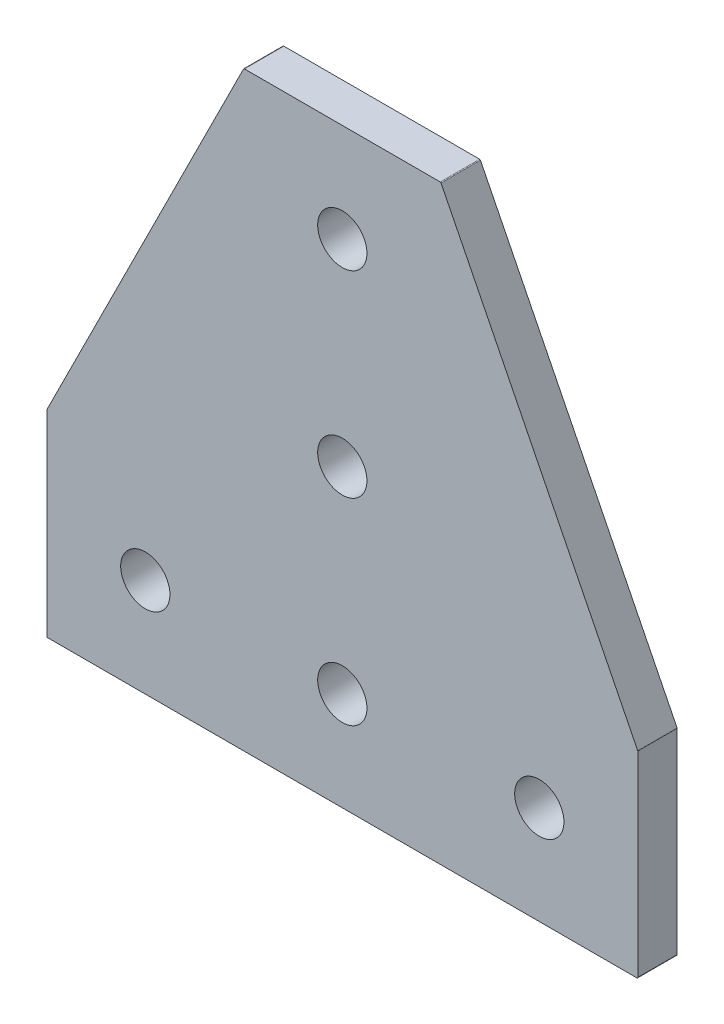
ISO-10303-21;
HEADER;
FILE_DESCRIPTION(('STEP AP214'),'2;1');
FILE_NAME('part.step','',(''),(''),'','','');
FILE_SCHEMA(('AUTOMOTIVE_DESIGN { 1 0 10303 214 1 1 1 1 }'));
ENDSEC;
DATA;
#1=APPLICATION_CONTEXT('core data for automotive mechanical design processes');
#2=APPLICATION_PROTOCOL_DEFINITION('international standard','automotive_design',2000,#1);
#3=PRODUCT_CONTEXT('',#1,'mechanical');
#4=PRODUCT('Part','Part','',(#3));
#5=PRODUCT_RELATED_PRODUCT_CATEGORY('part','',(#4));
#6=PRODUCT_DEFINITION_FORMATION('','',#4);
#7=PRODUCT_DEFINITION_CONTEXT('part definition',#1,'design');
#8=PRODUCT_DEFINITION('design','',#6,#7);
#9=PRODUCT_DEFINITION_SHAPE('','',#8);
#10=(LENGTH_UNIT() NAMED_UNIT(*) SI_UNIT(.MILLI.,.METRE.));
#11=(NAMED_UNIT(*) PLANE_ANGLE_UNIT() SI_UNIT($,.RADIAN.));
#12=(NAMED_UNIT(*) SI_UNIT($,.STERADIAN.) SOLID_ANGLE_UNIT());
#13=UNCERTAINTY_MEASURE_WITH_UNIT(LENGTH_MEASURE(1.E-05),#10,'distance_accuracy_value','');
#14=(GEOMETRIC_REPRESENTATION_CONTEXT(3) GLOBAL_UNCERTAINTY_ASSIGNED_CONTEXT((#13)) GLOBAL_UNIT_ASSIGNED_CONTEXT((#10,
#11,#12)) REPRESENTATION_CONTEXT('',''));
#15=CARTESIAN_POINT('',(0.,0.,0.));
#16=DIRECTION('',(0.,0.,1.));
#17=DIRECTION('',(1.,0.,0.));
#18=AXIS2_PLACEMENT_3D('',#15,#16,#17);
#19=CARTESIAN_POINT('',(0.,0.,-4.));
#20=DIRECTION('',(0.,-1.,0.));
#21=DIRECTION('',(0.,0.,-1.));
#22=AXIS2_PLACEMENT_3D('',#19,#20,#21);
#23=PLANE('',#22);
#24=DIRECTION('',(1.,0.,0.));
#25=VECTOR('',#24,1.);
#26=CARTESIAN_POINT('',(0.,0.,0.));
#27=LINE('',#26,#25);
#28=CARTESIAN_POINT('',(0.1,0.,0.));
#29=VERTEX_POINT('',#28);
#30=CARTESIAN_POINT('',(59.9,0.,0.));
#31=VERTEX_POINT('',#30);
#32=EDGE_CURVE('E214',#29,#31,#27,.T.);
#33=ORIENTED_EDGE('',*,*,#32,.F.);
#34=DIRECTION('',(0.,0.,1.));
#35=VECTOR('',#34,1.);
#36=CARTESIAN_POINT('',(0.1,0.,-4.));
#37=LINE('',#36,#35);
#38=CARTESIAN_POINT('',(0.1,0.,-4.));
#39=VERTEX_POINT('',#38);
#40=EDGE_CURVE('E171',#29,#39,#37,.F.);
#41=ORIENTED_EDGE('',*,*,#40,.T.);
#42=DIRECTION('',(1.,0.,0.));
#43=VECTOR('',#42,1.);
#44=CARTESIAN_POINT('',(0.,0.,-4.));
#45=LINE('',#44,#43);
#46=CARTESIAN_POINT('',(59.9,0.,-4.));
#47=VERTEX_POINT('',#46);
#48=EDGE_CURVE('E147',#39,#47,#45,.T.);
#49=ORIENTED_EDGE('',*,*,#48,.T.);
#50=DIRECTION('',(0.,0.,1.));
#51=VECTOR('',#50,1.);
#52=CARTESIAN_POINT('',(59.9,0.,-4.));
#53=LINE('',#52,#51);
#54=EDGE_CURVE('E168',#47,#31,#53,.T.);
#55=ORIENTED_EDGE('',*,*,#54,.T.);
#56=EDGE_LOOP('',(#33,#41,#49,#55));
#57=FACE_BOUND('',#56,.T.);
#58=ADVANCED_FACE('F35',(#57),#23,.T.);
#59=CARTESIAN_POINT('',(0.,20.,-4.));
#60=DIRECTION('',(-1.,0.,0.));
#61=DIRECTION('',(0.,0.,1.));
#62=AXIS2_PLACEMENT_3D('',#59,#60,#61);
#63=PLANE('',#62);
#64=DIRECTION('',(0.,-1.,0.));
#65=VECTOR('',#64,1.);
#66=CARTESIAN_POINT('',(0.,20.,-4.));
#67=LINE('',#66,#65);
#68=CARTESIAN_POINT('',(0.,19.97639320225,-4.));
#69=VERTEX_POINT('',#68);
#70=CARTESIAN_POINT('',(0.,0.0999999999999994,-4.));
#71=VERTEX_POINT('',#70);
#72=EDGE_CURVE('E219',#69,#71,#67,.T.);
#73=ORIENTED_EDGE('',*,*,#72,.T.);
#74=DIRECTION('',(0.,0.,1.));
#75=VECTOR('',#74,1.);
#76=CARTESIAN_POINT('',(0.,0.0999999999999994,-4.));
#77=LINE('',#76,#75);
#78=CARTESIAN_POINT('',(0.,0.0999999999999994,0.));
#79=VERTEX_POINT('',#78);
#80=EDGE_CURVE('E146',#71,#79,#77,.T.);
#81=ORIENTED_EDGE('',*,*,#80,.T.);
#82=DIRECTION('',(0.,-1.,0.));
#83=VECTOR('',#82,1.);
#84=CARTESIAN_POINT('',(0.,20.,0.));
#85=LINE('',#84,#83);
#86=CARTESIAN_POINT('',(0.,19.97639320225,0.));
#87=VERTEX_POINT('',#86);
#88=EDGE_CURVE('E129',#87,#79,#85,.T.);
#89=ORIENTED_EDGE('',*,*,#88,.F.);
#90=DIRECTION('',(0.,0.,1.));
#91=VECTOR('',#90,1.);
#92=CARTESIAN_POINT('',(0.,19.97639320225,-4.));
#93=LINE('',#92,#91);
#94=EDGE_CURVE('E143',#87,#69,#93,.F.);
#95=ORIENTED_EDGE('',*,*,#94,.T.);
#96=EDGE_LOOP('',(#73,#81,#89,#95));
#97=FACE_BOUND('',#96,.T.);
#98=ADVANCED_FACE('F142',(#97),#63,.T.);
#99=CARTESIAN_POINT('',(20.,60.,-4.));
#100=DIRECTION('',(-0.894427190999916,0.447213595499958,0.));
#101=DIRECTION('',(-0.447213595499958,-0.894427190999916,0.));
#102=AXIS2_PLACEMENT_3D('',#99,#100,#101);
#103=PLANE('',#102);
#104=DIRECTION('',(-0.447213595499958,-0.894427190999916,0.));
#105=VECTOR('',#104,1.);
#106=CARTESIAN_POINT('',(20.,60.,-4.));
#107=LINE('',#106,#105);
#108=CARTESIAN_POINT('',(19.972360679775,59.94472135955,-4.));
#109=VERTEX_POINT('',#108);
#110=CARTESIAN_POINT('',(0.010557280900006,20.0211145618,-4.));
#111=VERTEX_POINT('',#110);
#112=EDGE_CURVE('E222',#109,#111,#107,.T.);
#113=ORIENTED_EDGE('',*,*,#112,.T.);
#114=DIRECTION('',(0.,0.,1.));
#115=VECTOR('',#114,1.);
#116=CARTESIAN_POINT('',(0.0105572809000094,20.0211145618,-4.));
#117=LINE('',#116,#115);
#118=CARTESIAN_POINT('',(0.010557280900006,20.0211145618,0.));
#119=VERTEX_POINT('',#118);
#120=EDGE_CURVE('E185',#111,#119,#117,.T.);
#121=ORIENTED_EDGE('',*,*,#120,.T.);
#122=DIRECTION('',(-0.447213595499958,-0.894427190999916,0.));
#123=VECTOR('',#122,1.);
#124=CARTESIAN_POINT('',(20.,60.,0.));
#125=LINE('',#124,#123);
#126=CARTESIAN_POINT('',(19.972360679775,59.94472135955,0.));
#127=VERTEX_POINT('',#126);
#128=EDGE_CURVE('E131',#127,#119,#125,.T.);
#129=ORIENTED_EDGE('',*,*,#128,.F.);
#130=DIRECTION('',(0.,0.,1.));
#131=VECTOR('',#130,1.);
#132=CARTESIAN_POINT('',(19.972360679775,59.94472135955,-4.));
#133=LINE('',#132,#131);
#134=EDGE_CURVE('E183',#127,#109,#133,.F.);
#135=ORIENTED_EDGE('',*,*,#134,.T.);
#136=EDGE_LOOP('',(#113,#121,#129,#135));
#137=FACE_BOUND('',#136,.T.);
#138=ADVANCED_FACE('F257',(#137),#103,.T.);
#139=CARTESIAN_POINT('',(20.,60.,-4.));
#140=DIRECTION('',(0.,1.,0.));
#141=DIRECTION('',(-1.,0.,0.));
#142=AXIS2_PLACEMENT_3D('',#139,#140,#141);
#143=PLANE('',#142);
#144=DIRECTION('',(-1.,0.,0.));
#145=VECTOR('',#144,1.);
#146=CARTESIAN_POINT('',(20.,60.,-4.));
#147=LINE('',#146,#145);
#148=CARTESIAN_POINT('',(39.938196601125,60.,-4.));
#149=VERTEX_POINT('',#148);
#150=CARTESIAN_POINT('',(20.061803398875,60.,-4.));
#151=VERTEX_POINT('',#150);
#152=EDGE_CURVE('E225',#149,#151,#147,.T.);
#153=ORIENTED_EDGE('',*,*,#152,.T.);
#154=DIRECTION('',(0.,0.,1.));
#155=VECTOR('',#154,1.);
#156=CARTESIAN_POINT('',(20.061803398875,60.,-4.));
#157=LINE('',#156,#155);
#158=CARTESIAN_POINT('',(20.061803398875,60.,0.));
#159=VERTEX_POINT('',#158);
#160=EDGE_CURVE('E189',#151,#159,#157,.T.);
#161=ORIENTED_EDGE('',*,*,#160,.T.);
#162=DIRECTION('',(-1.,0.,0.));
#163=VECTOR('',#162,1.);
#164=CARTESIAN_POINT('',(20.,60.,0.));
#165=LINE('',#164,#163);
#166=CARTESIAN_POINT('',(39.938196601125,60.,0.));
#167=VERTEX_POINT('',#166);
#168=EDGE_CURVE('E210',#167,#159,#165,.T.);
#169=ORIENTED_EDGE('',*,*,#168,.F.);
#170=DIRECTION('',(0.,0.,1.));
#171=VECTOR('',#170,1.);
#172=CARTESIAN_POINT('',(39.938196601125,60.,-4.));
#173=LINE('',#172,#171);
#174=EDGE_CURVE('E187',#167,#149,#173,.F.);
#175=ORIENTED_EDGE('',*,*,#174,.T.);
#176=EDGE_LOOP('',(#153,#161,#169,#175));
#177=FACE_BOUND('',#176,.T.);
#178=ADVANCED_FACE('F250',(#177),#143,.T.);
#179=CARTESIAN_POINT('',(60.,20.,-4.));
#180=DIRECTION('',(0.894427190999916,0.447213595499958,0.));
#181=DIRECTION('',(-0.447213595499958,0.894427190999916,0.));
#182=AXIS2_PLACEMENT_3D('',#179,#180,#181);
#183=PLANE('',#182);
#184=DIRECTION('',(-0.447213595499958,0.894427190999916,0.));
#185=VECTOR('',#184,1.);
#186=CARTESIAN_POINT('',(60.,20.,0.));
#187=LINE('',#186,#185);
#188=CARTESIAN_POINT('',(59.9894427191,20.0211145618,0.));
#189=VERTEX_POINT('',#188);
#190=CARTESIAN_POINT('',(40.027639320225,59.94472135955,0.));
#191=VERTEX_POINT('',#190);
#192=EDGE_CURVE('E202',#189,#191,#187,.T.);
#193=ORIENTED_EDGE('',*,*,#192,.F.);
#194=DIRECTION('',(0.,0.,1.));
#195=VECTOR('',#194,1.);
#196=CARTESIAN_POINT('',(59.9894427191,20.0211145618,-4.));
#197=LINE('',#196,#195);
#198=CARTESIAN_POINT('',(59.9894427191,20.0211145618,-4.));
#199=VERTEX_POINT('',#198);
#200=EDGE_CURVE('E11',#189,#199,#197,.F.);
#201=ORIENTED_EDGE('',*,*,#200,.T.);
#202=DIRECTION('',(-0.447213595499958,0.894427190999916,0.));
#203=VECTOR('',#202,1.);
#204=CARTESIAN_POINT('',(60.,20.,-4.));
#205=LINE('',#204,#203);
#206=CARTESIAN_POINT('',(40.027639320225,59.94472135955,-4.));
#207=VERTEX_POINT('',#206);
#208=EDGE_CURVE('E204',#199,#207,#205,.T.);
#209=ORIENTED_EDGE('',*,*,#208,.T.);
#210=DIRECTION('',(0.,0.,1.));
#211=VECTOR('',#210,1.);
#212=CARTESIAN_POINT('',(40.027639320225,59.94472135955,-4.));
#213=LINE('',#212,#211);
#214=EDGE_CURVE('E43',#207,#191,#213,.T.);
#215=ORIENTED_EDGE('',*,*,#214,.T.);
#216=EDGE_LOOP('',(#193,#201,#209,#215));
#217=FACE_BOUND('',#216,.T.);
#218=ADVANCED_FACE('F201',(#217),#183,.T.);
#219=CARTESIAN_POINT('',(60.,0.,-4.));
#220=DIRECTION('',(1.,0.,0.));
#221=DIRECTION('',(0.,1.,0.));
#222=AXIS2_PLACEMENT_3D('',#219,#220,#221);
#223=PLANE('',#222);
#224=DIRECTION('',(0.,1.,0.));
#225=VECTOR('',#224,1.);
#226=CARTESIAN_POINT('',(60.,0.,0.));
#227=LINE('',#226,#225);
#228=CARTESIAN_POINT('',(60.,0.1,0.));
#229=VERTEX_POINT('',#228);
#230=CARTESIAN_POINT('',(60.,19.97639320225,0.));
#231=VERTEX_POINT('',#230);
#232=EDGE_CURVE('E211',#229,#231,#227,.T.);
#233=ORIENTED_EDGE('',*,*,#232,.F.);
#234=DIRECTION('',(0.,0.,1.));
#235=VECTOR('',#234,1.);
#236=CARTESIAN_POINT('',(60.,0.1,-4.));
#237=LINE('',#236,#235);
#238=CARTESIAN_POINT('',(60.,0.1,-4.));
#239=VERTEX_POINT('',#238);
#240=EDGE_CURVE('E57',#229,#239,#237,.F.);
#241=ORIENTED_EDGE('',*,*,#240,.T.);
#242=DIRECTION('',(0.,1.,0.));
#243=VECTOR('',#242,1.);
#244=CARTESIAN_POINT('',(60.,0.,-4.));
#245=LINE('',#244,#243);
#246=CARTESIAN_POINT('',(60.,19.97639320225,-4.));
#247=VERTEX_POINT('',#246);
#248=EDGE_CURVE('E244',#239,#247,#245,.T.);
#249=ORIENTED_EDGE('',*,*,#248,.T.);
#250=DIRECTION('',(0.,0.,1.));
#251=VECTOR('',#250,1.);
#252=CARTESIAN_POINT('',(60.,19.97639320225,-4.));
#253=LINE('',#252,#251);
#254=EDGE_CURVE('E192',#247,#231,#253,.T.);
#255=ORIENTED_EDGE('',*,*,#254,.T.);
#256=EDGE_LOOP('',(#233,#241,#249,#255));
#257=FACE_BOUND('',#256,.T.);
#258=ADVANCED_FACE('F270',(#257),#223,.T.);
#259=CARTESIAN_POINT('',(0.,0.,-4.));
#260=DIRECTION('',(0.,0.,1.));
#261=DIRECTION('',(1.,0.,0.));
#262=AXIS2_PLACEMENT_3D('',#259,#260,#261);
#263=PLANE('',#262);
#264=CARTESIAN_POINT('',(50.,10.,-4.));
#265=DIRECTION('',(0.,0.,1.));
#266=DIRECTION('',(1.,0.,0.));
#267=AXIS2_PLACEMENT_3D('',#264,#265,#266);
#268=CIRCLE('',#267,2.5);
#269=CARTESIAN_POINT('',(52.5,10.,-4.));
#270=VERTEX_POINT('',#269);
#271=EDGE_CURVE('E439',#270,#270,#268,.T.);
#272=ORIENTED_EDGE('',*,*,#271,.T.);
#273=EDGE_LOOP('',(#272));
#274=FACE_BOUND('',#273,.T.);
#275=CARTESIAN_POINT('',(10.,10.,-4.));
#276=DIRECTION('',(0.,0.,1.));
#277=DIRECTION('',(1.,0.,0.));
#278=AXIS2_PLACEMENT_3D('',#275,#276,#277);
#279=CIRCLE('',#278,2.5);
#280=CARTESIAN_POINT('',(12.5,10.,-4.));
#281=VERTEX_POINT('',#280);
#282=EDGE_CURVE('E443',#281,#281,#279,.T.);
#283=ORIENTED_EDGE('',*,*,#282,.T.);
#284=EDGE_LOOP('',(#283));
#285=FACE_BOUND('',#284,.T.);
#286=CARTESIAN_POINT('',(30.,30.,-4.));
#287=DIRECTION('',(0.,0.,1.));
#288=DIRECTION('',(1.,0.,0.));
#289=AXIS2_PLACEMENT_3D('',#286,#287,#288);
#290=CIRCLE('',#289,2.5);
#291=CARTESIAN_POINT('',(32.5,30.,-4.));
#292=VERTEX_POINT('',#291);
#293=EDGE_CURVE('E446',#292,#292,#290,.T.);
#294=ORIENTED_EDGE('',*,*,#293,.T.);
#295=EDGE_LOOP('',(#294));
#296=FACE_BOUND('',#295,.T.);
#297=CARTESIAN_POINT('',(30.,10.,-4.));
#298=DIRECTION('',(0.,0.,1.));
#299=DIRECTION('',(1.,0.,0.));
#300=AXIS2_PLACEMENT_3D('',#297,#298,#299);
#301=CIRCLE('',#300,2.5);
#302=CARTESIAN_POINT('',(32.5,10.,-4.));
#303=VERTEX_POINT('',#302);
#304=EDGE_CURVE('E229',#303,#303,#301,.T.);
#305=ORIENTED_EDGE('',*,*,#304,.T.);
#306=EDGE_LOOP('',(#305));
#307=FACE_BOUND('',#306,.T.);
#308=ORIENTED_EDGE('',*,*,#48,.F.);
#309=CARTESIAN_POINT('',(0.1,0.0999999999999994,-4.));
#310=DIRECTION('',(0.,0.,1.));
#311=DIRECTION('',(1.,0.,0.));
#312=AXIS2_PLACEMENT_3D('',#309,#310,#311);
#313=CIRCLE('',#312,0.1);
#314=EDGE_CURVE('E181',#39,#71,#313,.F.);
#315=ORIENTED_EDGE('',*,*,#314,.T.);
#316=ORIENTED_EDGE('',*,*,#72,.F.);
#317=CARTESIAN_POINT('',(0.0999999999999994,19.97639320225,-4.));
#318=DIRECTION('',(0.,0.,1.));
#319=DIRECTION('',(1.,0.,0.));
#320=AXIS2_PLACEMENT_3D('',#317,#318,#319);
#321=CIRCLE('',#320,0.1);
#322=EDGE_CURVE('E151',#69,#111,#321,.F.);
#323=ORIENTED_EDGE('',*,*,#322,.T.);
#324=ORIENTED_EDGE('',*,*,#112,.F.);
#325=CARTESIAN_POINT('',(20.061803398875,59.9,-4.));
#326=DIRECTION('',(0.,0.,1.));
#327=DIRECTION('',(1.,0.,0.));
#328=AXIS2_PLACEMENT_3D('',#325,#326,#327);
#329=CIRCLE('',#328,0.1);
#330=EDGE_CURVE('E178',#109,#151,#329,.F.);
#331=ORIENTED_EDGE('',*,*,#330,.T.);
#332=ORIENTED_EDGE('',*,*,#152,.F.);
#333=CARTESIAN_POINT('',(39.938196601125,59.9,-4.));
#334=DIRECTION('',(0.,0.,1.));
#335=DIRECTION('',(1.,0.,0.));
#336=AXIS2_PLACEMENT_3D('',#333,#334,#335);
#337=CIRCLE('',#336,0.1);
#338=EDGE_CURVE('E173',#149,#207,#337,.F.);
#339=ORIENTED_EDGE('',*,*,#338,.T.);
#340=ORIENTED_EDGE('',*,*,#208,.F.);
#341=CARTESIAN_POINT('',(59.9,19.97639320225,-4.));
#342=DIRECTION('',(0.,0.,1.));
#343=DIRECTION('',(1.,0.,0.));
#344=AXIS2_PLACEMENT_3D('',#341,#342,#343);
#345=CIRCLE('',#344,0.1);
#346=EDGE_CURVE('E50',#199,#247,#345,.F.);
#347=ORIENTED_EDGE('',*,*,#346,.T.);
#348=ORIENTED_EDGE('',*,*,#248,.F.);
#349=CARTESIAN_POINT('',(59.9,0.1,-4.));
#350=DIRECTION('',(0.,0.,1.));
#351=DIRECTION('',(1.,0.,0.));
#352=AXIS2_PLACEMENT_3D('',#349,#350,#351);
#353=CIRCLE('',#352,0.1);
#354=EDGE_CURVE('E176',#239,#47,#353,.F.);
#355=ORIENTED_EDGE('',*,*,#354,.T.);
#356=EDGE_LOOP('',(#308,#315,#316,#323,#324,#331,#332,#339,#340,#347,#348,#355));
#357=FACE_BOUND('',#356,.T.);
#358=CARTESIAN_POINT('',(30.,50.,-4.));
#359=DIRECTION('',(0.,0.,1.));
#360=DIRECTION('',(1.,0.,0.));
#361=AXIS2_PLACEMENT_3D('',#358,#359,#360);
#362=CIRCLE('',#361,2.5);
#363=CARTESIAN_POINT('',(32.5,50.,-4.));
#364=VERTEX_POINT('',#363);
#365=EDGE_CURVE('E157',#364,#364,#362,.T.);
#366=ORIENTED_EDGE('',*,*,#365,.T.);
#367=EDGE_LOOP('',(#366));
#368=FACE_BOUND('',#367,.T.);
#369=ADVANCED_FACE('F260',(#274,#285,#296,#307,#357,#368),#263,.F.);
#370=CARTESIAN_POINT('',(0.,0.,0.));
#371=DIRECTION('',(0.,0.,1.));
#372=DIRECTION('',(1.,0.,0.));
#373=AXIS2_PLACEMENT_3D('',#370,#371,#372);
#374=PLANE('',#373);
#375=CARTESIAN_POINT('',(50.,10.,0.));
#376=DIRECTION('',(0.,0.,1.));
#377=DIRECTION('',(1.,0.,0.));
#378=AXIS2_PLACEMENT_3D('',#375,#376,#377);
#379=CIRCLE('',#378,2.5);
#380=CARTESIAN_POINT('',(52.5,10.,0.));
#381=VERTEX_POINT('',#380);
#382=EDGE_CURVE('E453',#381,#381,#379,.T.);
#383=ORIENTED_EDGE('',*,*,#382,.F.);
#384=EDGE_LOOP('',(#383));
#385=FACE_BOUND('',#384,.T.);
#386=CARTESIAN_POINT('',(10.,10.,0.));
#387=DIRECTION('',(0.,0.,1.));
#388=DIRECTION('',(1.,0.,0.));
#389=AXIS2_PLACEMENT_3D('',#386,#387,#388);
#390=CIRCLE('',#389,2.5);
#391=CARTESIAN_POINT('',(12.5,10.,0.));
#392=VERTEX_POINT('',#391);
#393=EDGE_CURVE('E448',#392,#392,#390,.T.);
#394=ORIENTED_EDGE('',*,*,#393,.F.);
#395=EDGE_LOOP('',(#394));
#396=FACE_BOUND('',#395,.T.);
#397=CARTESIAN_POINT('',(30.,30.,0.));
#398=DIRECTION('',(0.,0.,1.));
#399=DIRECTION('',(1.,0.,0.));
#400=AXIS2_PLACEMENT_3D('',#397,#398,#399);
#401=CIRCLE('',#400,2.5);
#402=CARTESIAN_POINT('',(32.5,30.,0.));
#403=VERTEX_POINT('',#402);
#404=EDGE_CURVE('E237',#403,#403,#401,.T.);
#405=ORIENTED_EDGE('',*,*,#404,.F.);
#406=EDGE_LOOP('',(#405));
#407=FACE_BOUND('',#406,.T.);
#408=CARTESIAN_POINT('',(30.,10.,0.));
#409=DIRECTION('',(0.,0.,1.));
#410=DIRECTION('',(1.,0.,0.));
#411=AXIS2_PLACEMENT_3D('',#408,#409,#410);
#412=CIRCLE('',#411,2.5);
#413=CARTESIAN_POINT('',(32.5,10.,0.));
#414=VERTEX_POINT('',#413);
#415=EDGE_CURVE('E232',#414,#414,#412,.T.);
#416=ORIENTED_EDGE('',*,*,#415,.F.);
#417=EDGE_LOOP('',(#416));
#418=FACE_BOUND('',#417,.T.);
#419=ORIENTED_EDGE('',*,*,#88,.T.);
#420=CARTESIAN_POINT('',(0.1,0.0999999999999994,0.));
#421=DIRECTION('',(0.,0.,1.));
#422=DIRECTION('',(1.,0.,0.));
#423=AXIS2_PLACEMENT_3D('',#420,#421,#422);
#424=CIRCLE('',#423,0.1);
#425=EDGE_CURVE('E136',#79,#29,#424,.T.);
#426=ORIENTED_EDGE('',*,*,#425,.T.);
#427=ORIENTED_EDGE('',*,*,#32,.T.);
#428=CARTESIAN_POINT('',(59.9,0.1,0.));
#429=DIRECTION('',(0.,0.,1.));
#430=DIRECTION('',(1.,0.,0.));
#431=AXIS2_PLACEMENT_3D('',#428,#429,#430);
#432=CIRCLE('',#431,0.1);
#433=EDGE_CURVE('E164',#31,#229,#432,.T.);
#434=ORIENTED_EDGE('',*,*,#433,.T.);
#435=ORIENTED_EDGE('',*,*,#232,.T.);
#436=CARTESIAN_POINT('',(59.9,19.97639320225,0.));
#437=DIRECTION('',(0.,0.,1.));
#438=DIRECTION('',(1.,0.,0.));
#439=AXIS2_PLACEMENT_3D('',#436,#437,#438);
#440=CIRCLE('',#439,0.1);
#441=EDGE_CURVE('E162',#231,#189,#440,.T.);
#442=ORIENTED_EDGE('',*,*,#441,.T.);
#443=ORIENTED_EDGE('',*,*,#192,.T.);
#444=CARTESIAN_POINT('',(39.938196601125,59.9,0.));
#445=DIRECTION('',(0.,0.,1.));
#446=DIRECTION('',(1.,0.,0.));
#447=AXIS2_PLACEMENT_3D('',#444,#445,#446);
#448=CIRCLE('',#447,0.1);
#449=EDGE_CURVE('E154',#191,#167,#448,.T.);
#450=ORIENTED_EDGE('',*,*,#449,.T.);
#451=ORIENTED_EDGE('',*,*,#168,.T.);
#452=CARTESIAN_POINT('',(20.061803398875,59.9,0.));
#453=DIRECTION('',(0.,0.,1.));
#454=DIRECTION('',(1.,0.,0.));
#455=AXIS2_PLACEMENT_3D('',#452,#453,#454);
#456=CIRCLE('',#455,0.1);
#457=EDGE_CURVE('E137',#159,#127,#456,.T.);
#458=ORIENTED_EDGE('',*,*,#457,.T.);
#459=ORIENTED_EDGE('',*,*,#128,.T.);
#460=CARTESIAN_POINT('',(0.0999999999999994,19.97639320225,0.));
#461=DIRECTION('',(0.,0.,1.));
#462=DIRECTION('',(1.,0.,0.));
#463=AXIS2_PLACEMENT_3D('',#460,#461,#462);
#464=CIRCLE('',#463,0.1);
#465=EDGE_CURVE('E125',#119,#87,#464,.T.);
#466=ORIENTED_EDGE('',*,*,#465,.T.);
#467=EDGE_LOOP('',(#419,#426,#427,#434,#435,#442,#443,#450,#451,#458,#459,#466));
#468=FACE_BOUND('',#467,.T.);
#469=CARTESIAN_POINT('',(30.,50.,0.));
#470=DIRECTION('',(0.,0.,1.));
#471=DIRECTION('',(1.,0.,0.));
#472=AXIS2_PLACEMENT_3D('',#469,#470,#471);
#473=CIRCLE('',#472,2.5);
#474=CARTESIAN_POINT('',(32.5,50.,0.));
#475=VERTEX_POINT('',#474);
#476=EDGE_CURVE('E152',#475,#475,#473,.T.);
#477=ORIENTED_EDGE('',*,*,#476,.F.);
#478=EDGE_LOOP('',(#477));
#479=FACE_BOUND('',#478,.T.);
#480=ADVANCED_FACE('F127',(#385,#396,#407,#418,#468,#479),#374,.T.);
#481=CARTESIAN_POINT('',(30.,10.,-4.));
#482=DIRECTION('',(0.,0.,1.));
#483=DIRECTION('',(1.,0.,0.));
#484=AXIS2_PLACEMENT_3D('',#481,#482,#483);
#485=CYLINDRICAL_SURFACE('',#484,2.5);
#486=ORIENTED_EDGE('',*,*,#304,.F.);
#487=EDGE_LOOP('',(#486));
#488=FACE_BOUND('',#487,.T.);
#489=ORIENTED_EDGE('',*,*,#415,.T.);
#490=EDGE_LOOP('',(#489));
#491=FACE_BOUND('',#490,.T.);
#492=ADVANCED_FACE('F361',(#488,#491),#485,.F.);
#493=CARTESIAN_POINT('',(30.,30.,-4.));
#494=DIRECTION('',(0.,0.,1.));
#495=DIRECTION('',(1.,0.,0.));
#496=AXIS2_PLACEMENT_3D('',#493,#494,#495);
#497=CYLINDRICAL_SURFACE('',#496,2.5);
#498=ORIENTED_EDGE('',*,*,#293,.F.);
#499=EDGE_LOOP('',(#498));
#500=FACE_BOUND('',#499,.T.);
#501=ORIENTED_EDGE('',*,*,#404,.T.);
#502=EDGE_LOOP('',(#501));
#503=FACE_BOUND('',#502,.T.);
#504=ADVANCED_FACE('F291',(#500,#503),#497,.F.);
#505=CARTESIAN_POINT('',(30.,50.,-4.));
#506=DIRECTION('',(0.,0.,1.));
#507=DIRECTION('',(1.,0.,0.));
#508=AXIS2_PLACEMENT_3D('',#505,#506,#507);
#509=CYLINDRICAL_SURFACE('',#508,2.5);
#510=ORIENTED_EDGE('',*,*,#365,.F.);
#511=EDGE_LOOP('',(#510));
#512=FACE_BOUND('',#511,.T.);
#513=ORIENTED_EDGE('',*,*,#476,.T.);
#514=EDGE_LOOP('',(#513));
#515=FACE_BOUND('',#514,.T.);
#516=ADVANCED_FACE('F287',(#512,#515),#509,.F.);
#517=CARTESIAN_POINT('',(10.,10.,-4.));
#518=DIRECTION('',(0.,0.,1.));
#519=DIRECTION('',(1.,0.,0.));
#520=AXIS2_PLACEMENT_3D('',#517,#518,#519);
#521=CYLINDRICAL_SURFACE('',#520,2.5);
#522=ORIENTED_EDGE('',*,*,#282,.F.);
#523=EDGE_LOOP('',(#522));
#524=FACE_BOUND('',#523,.T.);
#525=ORIENTED_EDGE('',*,*,#393,.T.);
#526=EDGE_LOOP('',(#525));
#527=FACE_BOUND('',#526,.T.);
#528=ADVANCED_FACE('F290',(#524,#527),#521,.F.);
#529=CARTESIAN_POINT('',(50.,10.,-4.));
#530=DIRECTION('',(0.,0.,1.));
#531=DIRECTION('',(1.,0.,0.));
#532=AXIS2_PLACEMENT_3D('',#529,#530,#531);
#533=CYLINDRICAL_SURFACE('',#532,2.5);
#534=ORIENTED_EDGE('',*,*,#271,.F.);
#535=EDGE_LOOP('',(#534));
#536=FACE_BOUND('',#535,.T.);
#537=ORIENTED_EDGE('',*,*,#382,.T.);
#538=EDGE_LOOP('',(#537));
#539=FACE_BOUND('',#538,.T.);
#540=ADVANCED_FACE('F295',(#536,#539),#533,.F.);
#541=CARTESIAN_POINT('',(0.1,0.0999999999999994,-4.));
#542=DIRECTION('',(0.,0.,1.));
#543=DIRECTION('',(1.,0.,0.));
#544=AXIS2_PLACEMENT_3D('',#541,#542,#543);
#545=CYLINDRICAL_SURFACE('',#544,0.1);
#546=ORIENTED_EDGE('',*,*,#314,.F.);
#547=ORIENTED_EDGE('',*,*,#40,.F.);
#548=ORIENTED_EDGE('',*,*,#425,.F.);
#549=ORIENTED_EDGE('',*,*,#80,.F.);
#550=EDGE_LOOP('',(#546,#547,#548,#549));
#551=FACE_BOUND('',#550,.T.);
#552=ADVANCED_FACE('F264',(#551),#545,.T.);
#553=CARTESIAN_POINT('',(0.0999999999999994,19.97639320225,-4.));
#554=DIRECTION('',(0.,0.,1.));
#555=DIRECTION('',(1.,0.,0.));
#556=AXIS2_PLACEMENT_3D('',#553,#554,#555);
#557=CYLINDRICAL_SURFACE('',#556,0.1);
#558=ORIENTED_EDGE('',*,*,#322,.F.);
#559=ORIENTED_EDGE('',*,*,#94,.F.);
#560=ORIENTED_EDGE('',*,*,#465,.F.);
#561=ORIENTED_EDGE('',*,*,#120,.F.);
#562=EDGE_LOOP('',(#558,#559,#560,#561));
#563=FACE_BOUND('',#562,.T.);
#564=ADVANCED_FACE('F150',(#563),#557,.T.);
#565=CARTESIAN_POINT('',(20.061803398875,59.9,-4.));
#566=DIRECTION('',(0.,0.,1.));
#567=DIRECTION('',(1.,0.,0.));
#568=AXIS2_PLACEMENT_3D('',#565,#566,#567);
#569=CYLINDRICAL_SURFACE('',#568,0.1);
#570=ORIENTED_EDGE('',*,*,#330,.F.);
#571=ORIENTED_EDGE('',*,*,#134,.F.);
#572=ORIENTED_EDGE('',*,*,#457,.F.);
#573=ORIENTED_EDGE('',*,*,#160,.F.);
#574=EDGE_LOOP('',(#570,#571,#572,#573));
#575=FACE_BOUND('',#574,.T.);
#576=ADVANCED_FACE('F254',(#575),#569,.T.);
#577=CARTESIAN_POINT('',(59.9,0.1,-4.));
#578=DIRECTION('',(0.,0.,1.));
#579=DIRECTION('',(1.,0.,0.));
#580=AXIS2_PLACEMENT_3D('',#577,#578,#579);
#581=CYLINDRICAL_SURFACE('',#580,0.1);
#582=ORIENTED_EDGE('',*,*,#354,.F.);
#583=ORIENTED_EDGE('',*,*,#240,.F.);
#584=ORIENTED_EDGE('',*,*,#433,.F.);
#585=ORIENTED_EDGE('',*,*,#54,.F.);
#586=EDGE_LOOP('',(#582,#583,#584,#585));
#587=FACE_BOUND('',#586,.T.);
#588=ADVANCED_FACE('F269',(#587),#581,.T.);
#589=CARTESIAN_POINT('',(59.9,19.97639320225,-4.));
#590=DIRECTION('',(0.,0.,1.));
#591=DIRECTION('',(1.,0.,0.));
#592=AXIS2_PLACEMENT_3D('',#589,#590,#591);
#593=CYLINDRICAL_SURFACE('',#592,0.1);
#594=ORIENTED_EDGE('',*,*,#346,.F.);
#595=ORIENTED_EDGE('',*,*,#200,.F.);
#596=ORIENTED_EDGE('',*,*,#441,.F.);
#597=ORIENTED_EDGE('',*,*,#254,.F.);
#598=EDGE_LOOP('',(#594,#595,#596,#597));
#599=FACE_BOUND('',#598,.T.);
#600=ADVANCED_FACE('F273',(#599),#593,.T.);
#601=CARTESIAN_POINT('',(39.938196601125,59.9,-4.));
#602=DIRECTION('',(0.,0.,1.));
#603=DIRECTION('',(1.,0.,0.));
#604=AXIS2_PLACEMENT_3D('',#601,#602,#603);
#605=CYLINDRICAL_SURFACE('',#604,0.1);
#606=ORIENTED_EDGE('',*,*,#338,.F.);
#607=ORIENTED_EDGE('',*,*,#174,.F.);
#608=ORIENTED_EDGE('',*,*,#449,.F.);
#609=ORIENTED_EDGE('',*,*,#214,.F.);
#610=EDGE_LOOP('',(#606,#607,#608,#609));
#611=FACE_BOUND('',#610,.T.);
#612=ADVANCED_FACE('F37',(#611),#605,.T.);
#613=CLOSED_SHELL('',(#58,#98,#138,#178,#218,#258,#369,#480,#492,#504,#516,#528,#540,#552,#564,
#576,#588,#600,#612));
#614=MANIFOLD_SOLID_BREP('B2',#613);
#615=ADVANCED_BREP_SHAPE_REPRESENTATION('',(#18,#614),#14);
#616=SHAPE_DEFINITION_REPRESENTATION(#9,#615);
ENDSEC;
END-ISO-10303-21;
